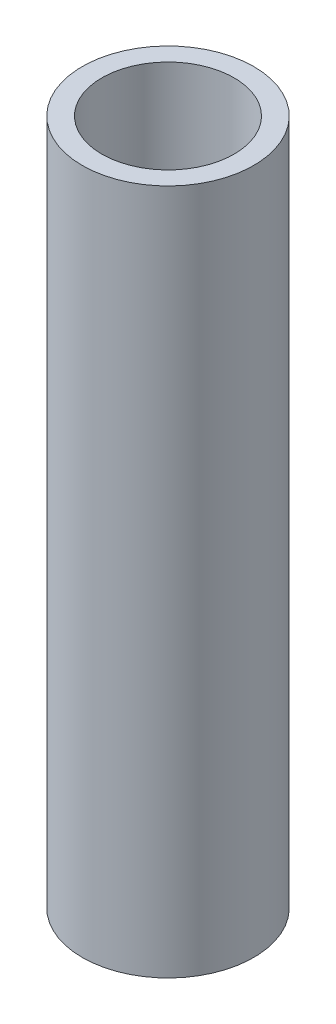
ISO-10303-21;
HEADER;
FILE_DESCRIPTION(('STEP AP214'),'2;1');
FILE_NAME('part.step','',(''),(''),'','','');
FILE_SCHEMA(('AUTOMOTIVE_DESIGN { 1 0 10303 214 1 1 1 1 }'));
ENDSEC;
DATA;
#1=APPLICATION_CONTEXT('core data for automotive mechanical design processes');
#2=APPLICATION_PROTOCOL_DEFINITION('international standard','automotive_design',2000,#1);
#3=PRODUCT_CONTEXT('',#1,'mechanical');
#4=PRODUCT('Part','Part','',(#3));
#5=PRODUCT_RELATED_PRODUCT_CATEGORY('part','',(#4));
#6=PRODUCT_DEFINITION_FORMATION('','',#4);
#7=PRODUCT_DEFINITION_CONTEXT('part definition',#1,'design');
#8=PRODUCT_DEFINITION('design','',#6,#7);
#9=PRODUCT_DEFINITION_SHAPE('','',#8);
#10=(LENGTH_UNIT() NAMED_UNIT(*) SI_UNIT(.MILLI.,.METRE.));
#11=(NAMED_UNIT(*) PLANE_ANGLE_UNIT() SI_UNIT($,.RADIAN.));
#12=(NAMED_UNIT(*) SI_UNIT($,.STERADIAN.) SOLID_ANGLE_UNIT());
#13=UNCERTAINTY_MEASURE_WITH_UNIT(LENGTH_MEASURE(1.E-05),#10,'distance_accuracy_value','');
#14=(GEOMETRIC_REPRESENTATION_CONTEXT(3) GLOBAL_UNCERTAINTY_ASSIGNED_CONTEXT((#13)) GLOBAL_UNIT_ASSIGNED_CONTEXT((#10,
#11,#12)) REPRESENTATION_CONTEXT('',''));
#15=CARTESIAN_POINT('',(0.,0.,0.));
#16=DIRECTION('',(0.,0.,1.));
#17=DIRECTION('',(1.,0.,0.));
#18=AXIS2_PLACEMENT_3D('',#15,#16,#17);
#19=CARTESIAN_POINT('',(0.,70.,0.));
#20=DIRECTION('',(0.,1.,0.));
#21=DIRECTION('',(0.,0.,1.));
#22=AXIS2_PLACEMENT_3D('',#19,#20,#21);
#23=PLANE('',#22);
#24=CARTESIAN_POINT('',(0.,70.,0.));
#25=DIRECTION('',(0.,1.,0.));
#26=DIRECTION('',(0.,0.,1.));
#27=AXIS2_PLACEMENT_3D('',#24,#25,#26);
#28=CIRCLE('',#27,8.75);
#29=CARTESIAN_POINT('',(0.,70.,8.75));
#30=VERTEX_POINT('',#29);
#31=EDGE_CURVE('E10',#30,#30,#28,.T.);
#32=ORIENTED_EDGE('',*,*,#31,.T.);
#33=EDGE_LOOP('',(#32));
#34=FACE_BOUND('',#33,.T.);
#35=CARTESIAN_POINT('',(0.,70.,0.));
#36=DIRECTION('',(0.,1.,0.));
#37=DIRECTION('',(0.,0.,1.));
#38=AXIS2_PLACEMENT_3D('',#35,#36,#37);
#39=CIRCLE('',#38,6.75);
#40=CARTESIAN_POINT('',(0.,70.,6.75));
#41=VERTEX_POINT('',#40);
#42=EDGE_CURVE('E50',#41,#41,#39,.T.);
#43=ORIENTED_EDGE('',*,*,#42,.F.);
#44=EDGE_LOOP('',(#43));
#45=FACE_BOUND('',#44,.T.);
#46=ADVANCED_FACE('F37',(#34,#45),#23,.T.);
#47=CARTESIAN_POINT('',(0.,0.,0.));
#48=DIRECTION('',(0.,1.,0.));
#49=DIRECTION('',(0.,0.,1.));
#50=AXIS2_PLACEMENT_3D('',#47,#48,#49);
#51=PLANE('',#50);
#52=CARTESIAN_POINT('',(0.,0.,0.));
#53=DIRECTION('',(0.,1.,0.));
#54=DIRECTION('',(0.,0.,1.));
#55=AXIS2_PLACEMENT_3D('',#52,#53,#54);
#56=CIRCLE('',#55,8.75);
#57=CARTESIAN_POINT('',(0.,0.,8.75));
#58=VERTEX_POINT('',#57);
#59=EDGE_CURVE('E41',#58,#58,#56,.T.);
#60=ORIENTED_EDGE('',*,*,#59,.F.);
#61=EDGE_LOOP('',(#60));
#62=FACE_BOUND('',#61,.T.);
#63=CARTESIAN_POINT('',(0.,0.,0.));
#64=DIRECTION('',(0.,1.,0.));
#65=DIRECTION('',(0.,0.,1.));
#66=AXIS2_PLACEMENT_3D('',#63,#64,#65);
#67=CIRCLE('',#66,6.75);
#68=CARTESIAN_POINT('',(0.,0.,6.75));
#69=VERTEX_POINT('',#68);
#70=EDGE_CURVE('E52',#69,#69,#67,.T.);
#71=ORIENTED_EDGE('',*,*,#70,.T.);
#72=EDGE_LOOP('',(#71));
#73=FACE_BOUND('',#72,.T.);
#74=ADVANCED_FACE('F64',(#62,#73),#51,.F.);
#75=CARTESIAN_POINT('',(0.,70.,0.));
#76=DIRECTION('',(0.,-1.,0.));
#77=DIRECTION('',(0.,0.,-1.));
#78=AXIS2_PLACEMENT_3D('',#75,#76,#77);
#79=CYLINDRICAL_SURFACE('',#78,8.75);
#80=ORIENTED_EDGE('',*,*,#31,.F.);
#81=EDGE_LOOP('',(#80));
#82=FACE_BOUND('',#81,.T.);
#83=ORIENTED_EDGE('',*,*,#59,.T.);
#84=EDGE_LOOP('',(#83));
#85=FACE_BOUND('',#84,.T.);
#86=ADVANCED_FACE('F39',(#82,#85),#79,.T.);
#87=CARTESIAN_POINT('',(0.,70.,0.));
#88=DIRECTION('',(0.,-1.,0.));
#89=DIRECTION('',(0.,0.,-1.));
#90=AXIS2_PLACEMENT_3D('',#87,#88,#89);
#91=CYLINDRICAL_SURFACE('',#90,6.75);
#92=ORIENTED_EDGE('',*,*,#42,.T.);
#93=EDGE_LOOP('',(#92));
#94=FACE_BOUND('',#93,.T.);
#95=ORIENTED_EDGE('',*,*,#70,.F.);
#96=EDGE_LOOP('',(#95));
#97=FACE_BOUND('',#96,.T.);
#98=ADVANCED_FACE('F60',(#94,#97),#91,.F.);
#99=CLOSED_SHELL('',(#46,#74,#86,#98));
#100=MANIFOLD_SOLID_BREP('B2',#99);
#101=ADVANCED_BREP_SHAPE_REPRESENTATION('',(#18,#100),#14);
#102=SHAPE_DEFINITION_REPRESENTATION(#9,#101);
ENDSEC;
END-ISO-10303-21;
